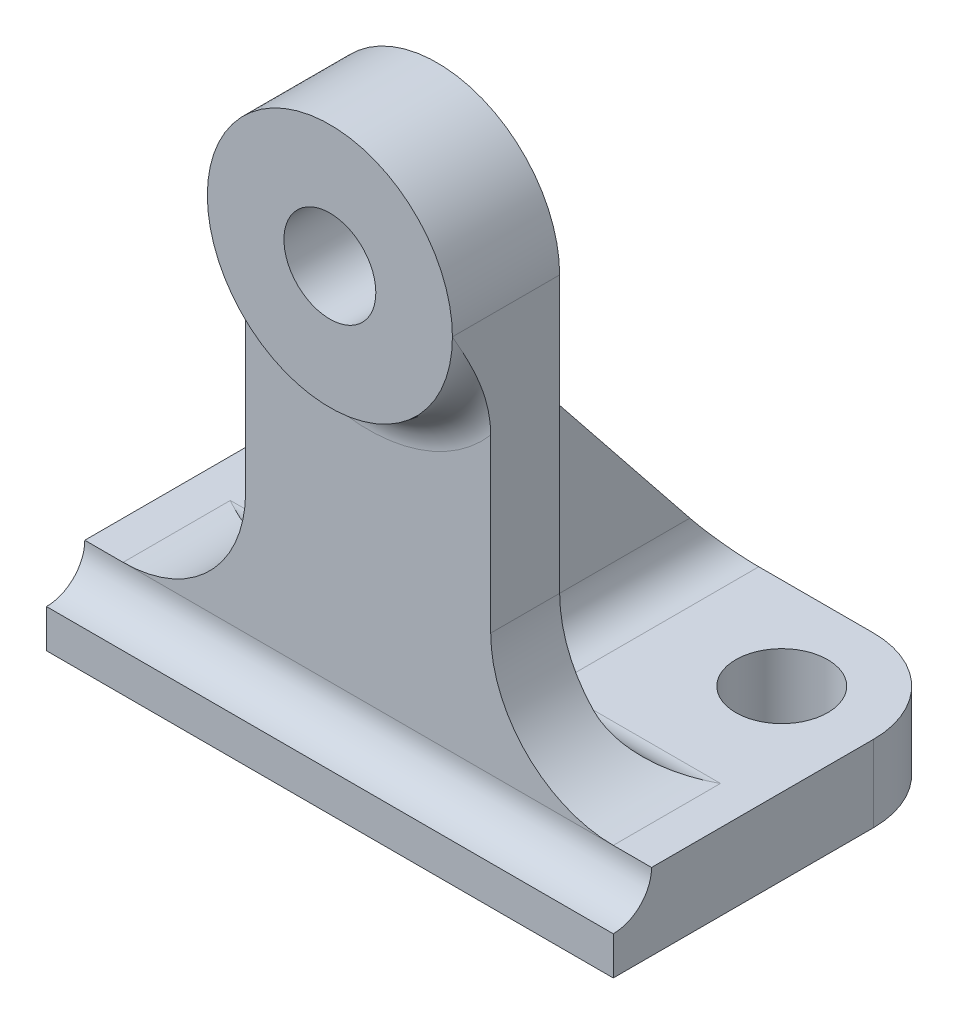
ISO-10303-21;
HEADER;
FILE_DESCRIPTION(('STEP AP214'),'2;1');
FILE_NAME('part.step','',(''),(''),'','','');
FILE_SCHEMA(('AUTOMOTIVE_DESIGN { 1 0 10303 214 1 1 1 1 }'));
ENDSEC;
DATA;
#1=APPLICATION_CONTEXT('core data for automotive mechanical design processes');
#2=APPLICATION_PROTOCOL_DEFINITION('international standard','automotive_design',2000,#1);
#3=PRODUCT_CONTEXT('',#1,'mechanical');
#4=PRODUCT('Part','Part','',(#3));
#5=PRODUCT_RELATED_PRODUCT_CATEGORY('part','',(#4));
#6=PRODUCT_DEFINITION_FORMATION('','',#4);
#7=PRODUCT_DEFINITION_CONTEXT('part definition',#1,'design');
#8=PRODUCT_DEFINITION('design','',#6,#7);
#9=PRODUCT_DEFINITION_SHAPE('','',#8);
#10=(LENGTH_UNIT() NAMED_UNIT(*) SI_UNIT(.MILLI.,.METRE.));
#11=(NAMED_UNIT(*) PLANE_ANGLE_UNIT() SI_UNIT($,.RADIAN.));
#12=(NAMED_UNIT(*) SI_UNIT($,.STERADIAN.) SOLID_ANGLE_UNIT());
#13=UNCERTAINTY_MEASURE_WITH_UNIT(LENGTH_MEASURE(1.E-05),#10,'distance_accuracy_value','');
#14=(GEOMETRIC_REPRESENTATION_CONTEXT(3) GLOBAL_UNCERTAINTY_ASSIGNED_CONTEXT((#13)) GLOBAL_UNIT_ASSIGNED_CONTEXT((#10,
#11,#12)) REPRESENTATION_CONTEXT('',''));
#15=CARTESIAN_POINT('',(0.,0.,0.));
#16=DIRECTION('',(0.,0.,1.));
#17=DIRECTION('',(1.,0.,0.));
#18=AXIS2_PLACEMENT_3D('',#15,#16,#17);
#19=CARTESIAN_POINT('',(12.,10.,-34.));
#20=DIRECTION('',(0.,-1.,0.));
#21=DIRECTION('',(0.,0.,-1.));
#22=AXIS2_PLACEMENT_3D('',#19,#20,#21);
#23=PLANE('',#22);
#24=CARTESIAN_POINT('',(62.,10.,-34.));
#25=DIRECTION('',(0.,1.,0.));
#26=DIRECTION('',(0.,0.,1.));
#27=AXIS2_PLACEMENT_3D('',#24,#25,#26);
#28=CIRCLE('',#27,6.);
#29=CARTESIAN_POINT('',(62.,10.,-28.));
#30=VERTEX_POINT('',#29);
#31=EDGE_CURVE('E578',#30,#30,#28,.T.);
#32=ORIENTED_EDGE('',*,*,#31,.F.);
#33=EDGE_LOOP('',(#32));
#34=FACE_BOUND('',#33,.T.);
#35=DIRECTION('',(-1.,0.,0.));
#36=VECTOR('',#35,1.);
#37=CARTESIAN_POINT('',(12.0000000000001,10.,-46.));
#38=LINE('',#37,#36);
#39=CARTESIAN_POINT('',(62.,10.,-46.));
#40=VERTEX_POINT('',#39);
#41=CARTESIAN_POINT('',(47.,10.,-46.));
#42=VERTEX_POINT('',#41);
#43=EDGE_CURVE('E240',#40,#42,#38,.T.);
#44=ORIENTED_EDGE('',*,*,#43,.T.);
#45=DIRECTION('',(0.,0.,-1.));
#46=VECTOR('',#45,1.);
#47=CARTESIAN_POINT('',(47.,10.,-19.));
#48=LINE('',#47,#46);
#49=CARTESIAN_POINT('',(47.,10.,-19.));
#50=VERTEX_POINT('',#49);
#51=EDGE_CURVE('E443',#42,#50,#48,.F.);
#52=ORIENTED_EDGE('',*,*,#51,.T.);
#53=DIRECTION('',(1.,0.,0.));
#54=VECTOR('',#53,1.);
#55=CARTESIAN_POINT('',(53.,10.,-19.));
#56=LINE('',#55,#54);
#57=CARTESIAN_POINT('',(69.,10.,-19.));
#58=VERTEX_POINT('',#57);
#59=EDGE_CURVE('E248',#50,#58,#56,.T.);
#60=ORIENTED_EDGE('',*,*,#59,.T.);
#61=DIRECTION('',(0.,0.,1.));
#62=VECTOR('',#61,1.);
#63=CARTESIAN_POINT('',(69.,10.,-5.));
#64=LINE('',#63,#62);
#65=CARTESIAN_POINT('',(69.,10.,-5.));
#66=VERTEX_POINT('',#65);
#67=EDGE_CURVE('E214',#58,#66,#64,.T.);
#68=ORIENTED_EDGE('',*,*,#67,.T.);
#69=DIRECTION('',(-1.,0.,0.));
#70=VECTOR('',#69,1.);
#71=CARTESIAN_POINT('',(74.,10.,-5.));
#72=LINE('',#71,#70);
#73=CARTESIAN_POINT('',(74.,10.,-5.));
#74=VERTEX_POINT('',#73);
#75=EDGE_CURVE('E199',#74,#66,#72,.T.);
#76=ORIENTED_EDGE('',*,*,#75,.F.);
#77=DIRECTION('',(0.,0.,-1.));
#78=VECTOR('',#77,1.);
#79=CARTESIAN_POINT('',(74.,10.,0.));
#80=LINE('',#79,#78);
#81=CARTESIAN_POINT('',(74.,10.,-34.));
#82=VERTEX_POINT('',#81);
#83=EDGE_CURVE('E211',#74,#82,#80,.T.);
#84=ORIENTED_EDGE('',*,*,#83,.T.);
#85=CARTESIAN_POINT('',(62.,10.,-34.));
#86=DIRECTION('',(0.,1.,0.));
#87=DIRECTION('',(0.,0.,-1.));
#88=AXIS2_PLACEMENT_3D('',#85,#86,#87);
#89=CIRCLE('',#88,12.);
#90=EDGE_CURVE('E221',#82,#40,#89,.T.);
#91=ORIENTED_EDGE('',*,*,#90,.T.);
#92=EDGE_LOOP('',(#44,#52,#60,#68,#76,#84,#91));
#93=FACE_BOUND('',#92,.T.);
#94=ADVANCED_FACE('F40',(#34,#93),#23,.F.);
#95=CARTESIAN_POINT('',(12.,10.,-34.));
#96=DIRECTION('',(0.,1.,0.));
#97=DIRECTION('',(0.,0.,1.));
#98=AXIS2_PLACEMENT_3D('',#95,#96,#97);
#99=CIRCLE('',#98,6.);
#100=CARTESIAN_POINT('',(12.,10.,-28.));
#101=VERTEX_POINT('',#100);
#102=EDGE_CURVE('E430',#101,#101,#99,.T.);
#103=ORIENTED_EDGE('',*,*,#102,.F.);
#104=EDGE_LOOP('',(#103));
#105=FACE_BOUND('',#104,.T.);
#106=DIRECTION('',(1.,0.,0.));
#107=VECTOR('',#106,1.);
#108=CARTESIAN_POINT('',(32.,10.,-19.));
#109=LINE('',#108,#107);
#110=CARTESIAN_POINT('',(5.00000000000004,10.,-19.));
#111=VERTEX_POINT('',#110);
#112=CARTESIAN_POINT('',(27.,10.,-19.));
#113=VERTEX_POINT('',#112);
#114=EDGE_CURVE('E245',#111,#113,#109,.T.);
#115=ORIENTED_EDGE('',*,*,#114,.T.);
#116=DIRECTION('',(0.,0.,-1.));
#117=VECTOR('',#116,1.);
#118=CARTESIAN_POINT('',(27.,10.,-34.));
#119=LINE('',#118,#117);
#120=CARTESIAN_POINT('',(27.,10.,-46.));
#121=VERTEX_POINT('',#120);
#122=EDGE_CURVE('E459',#113,#121,#119,.T.);
#123=ORIENTED_EDGE('',*,*,#122,.T.);
#124=CARTESIAN_POINT('',(12.0000000000001,10.,-46.));
#125=VERTEX_POINT('',#124);
#126=EDGE_CURVE('E224',#121,#125,#38,.T.);
#127=ORIENTED_EDGE('',*,*,#126,.T.);
#128=CARTESIAN_POINT('',(12.,10.,-34.));
#129=DIRECTION('',(0.,1.,0.));
#130=DIRECTION('',(0.,0.,-1.));
#131=AXIS2_PLACEMENT_3D('',#128,#129,#130);
#132=CIRCLE('',#131,12.);
#133=CARTESIAN_POINT('',(0.,10.,-33.9999999999999));
#134=VERTEX_POINT('',#133);
#135=EDGE_CURVE('E233',#125,#134,#132,.T.);
#136=ORIENTED_EDGE('',*,*,#135,.T.);
#137=DIRECTION('',(0.,0.,1.));
#138=VECTOR('',#137,1.);
#139=CARTESIAN_POINT('',(0.,10.,0.));
#140=LINE('',#139,#138);
#141=CARTESIAN_POINT('',(0.,10.,-5.));
#142=VERTEX_POINT('',#141);
#143=EDGE_CURVE('E222',#134,#142,#140,.T.);
#144=ORIENTED_EDGE('',*,*,#143,.T.);
#145=CARTESIAN_POINT('',(5.00000000000005,10.,-5.));
#146=VERTEX_POINT('',#145);
#147=EDGE_CURVE('E205',#146,#142,#72,.T.);
#148=ORIENTED_EDGE('',*,*,#147,.F.);
#149=DIRECTION('',(0.,0.,-1.));
#150=VECTOR('',#149,1.);
#151=CARTESIAN_POINT('',(5.00000000000004,10.,-19.));
#152=LINE('',#151,#150);
#153=EDGE_CURVE('E290',#146,#111,#152,.T.);
#154=ORIENTED_EDGE('',*,*,#153,.T.);
#155=EDGE_LOOP('',(#115,#123,#127,#136,#144,#148,#154));
#156=FACE_BOUND('',#155,.T.);
#157=ADVANCED_FACE('F352',(#105,#156),#23,.F.);
#158=CARTESIAN_POINT('',(0.,10.,0.));
#159=DIRECTION('',(0.,0.,-1.));
#160=DIRECTION('',(-1.,0.,0.));
#161=AXIS2_PLACEMENT_3D('',#158,#159,#160);
#162=PLANE('',#161);
#163=DIRECTION('',(-1.,0.,0.));
#164=VECTOR('',#163,1.);
#165=CARTESIAN_POINT('',(74.,5.,0.));
#166=LINE('',#165,#164);
#167=CARTESIAN_POINT('',(0.,5.,0.));
#168=VERTEX_POINT('',#167);
#169=CARTESIAN_POINT('',(74.,5.,0.));
#170=VERTEX_POINT('',#169);
#171=EDGE_CURVE('E201',#168,#170,#166,.F.);
#172=ORIENTED_EDGE('',*,*,#171,.F.);
#173=DIRECTION('',(0.,-1.,0.));
#174=VECTOR('',#173,1.);
#175=CARTESIAN_POINT('',(0.,10.,0.));
#176=LINE('',#175,#174);
#177=CARTESIAN_POINT('',(0.,0.,0.));
#178=VERTEX_POINT('',#177);
#179=EDGE_CURVE('E243',#168,#178,#176,.T.);
#180=ORIENTED_EDGE('',*,*,#179,.T.);
#181=DIRECTION('',(1.,0.,0.));
#182=VECTOR('',#181,1.);
#183=CARTESIAN_POINT('',(0.,0.,0.));
#184=LINE('',#183,#182);
#185=CARTESIAN_POINT('',(74.,0.,0.));
#186=VERTEX_POINT('',#185);
#187=EDGE_CURVE('E422',#178,#186,#184,.T.);
#188=ORIENTED_EDGE('',*,*,#187,.T.);
#189=DIRECTION('',(0.,-1.,0.));
#190=VECTOR('',#189,1.);
#191=CARTESIAN_POINT('',(74.,10.,0.));
#192=LINE('',#191,#190);
#193=EDGE_CURVE('E419',#170,#186,#192,.T.);
#194=ORIENTED_EDGE('',*,*,#193,.F.);
#195=EDGE_LOOP('',(#172,#180,#188,#194));
#196=FACE_BOUND('',#195,.T.);
#197=ADVANCED_FACE('F358',(#196),#162,.F.);
#198=CARTESIAN_POINT('',(12.,0.,-34.));
#199=DIRECTION('',(0.,-1.,0.));
#200=DIRECTION('',(0.,0.,-1.));
#201=AXIS2_PLACEMENT_3D('',#198,#199,#200);
#202=PLANE('',#201);
#203=CARTESIAN_POINT('',(12.,0.,-34.));
#204=DIRECTION('',(0.,1.,0.));
#205=DIRECTION('',(0.,0.,1.));
#206=AXIS2_PLACEMENT_3D('',#203,#204,#205);
#207=CIRCLE('',#206,6.);
#208=CARTESIAN_POINT('',(12.,0.,-28.));
#209=VERTEX_POINT('',#208);
#210=EDGE_CURVE('E432',#209,#209,#207,.T.);
#211=ORIENTED_EDGE('',*,*,#210,.T.);
#212=EDGE_LOOP('',(#211));
#213=FACE_BOUND('',#212,.T.);
#214=DIRECTION('',(0.,0.,1.));
#215=VECTOR('',#214,1.);
#216=CARTESIAN_POINT('',(0.,0.,0.));
#217=LINE('',#216,#215);
#218=CARTESIAN_POINT('',(0.,0.,-33.9999999999999));
#219=VERTEX_POINT('',#218);
#220=EDGE_CURVE('E426',#219,#178,#217,.T.);
#221=ORIENTED_EDGE('',*,*,#220,.F.);
#222=CARTESIAN_POINT('',(12.,0.,-34.));
#223=DIRECTION('',(0.,1.,0.));
#224=DIRECTION('',(0.,0.,-1.));
#225=AXIS2_PLACEMENT_3D('',#222,#223,#224);
#226=CIRCLE('',#225,12.);
#227=CARTESIAN_POINT('',(12.0000000000001,0.,-46.));
#228=VERTEX_POINT('',#227);
#229=EDGE_CURVE('E227',#228,#219,#226,.T.);
#230=ORIENTED_EDGE('',*,*,#229,.F.);
#231=DIRECTION('',(-1.,0.,0.));
#232=VECTOR('',#231,1.);
#233=CARTESIAN_POINT('',(12.0000000000001,0.,-46.));
#234=LINE('',#233,#232);
#235=CARTESIAN_POINT('',(62.,0.,-46.));
#236=VERTEX_POINT('',#235);
#237=EDGE_CURVE('E437',#236,#228,#234,.T.);
#238=ORIENTED_EDGE('',*,*,#237,.F.);
#239=CARTESIAN_POINT('',(62.,0.,-34.));
#240=DIRECTION('',(0.,1.,0.));
#241=DIRECTION('',(0.,0.,-1.));
#242=AXIS2_PLACEMENT_3D('',#239,#240,#241);
#243=CIRCLE('',#242,12.);
#244=CARTESIAN_POINT('',(74.,0.,-34.));
#245=VERTEX_POINT('',#244);
#246=EDGE_CURVE('E436',#245,#236,#243,.T.);
#247=ORIENTED_EDGE('',*,*,#246,.F.);
#248=DIRECTION('',(0.,0.,-1.));
#249=VECTOR('',#248,1.);
#250=CARTESIAN_POINT('',(74.,0.,0.));
#251=LINE('',#250,#249);
#252=EDGE_CURVE('E428',#186,#245,#251,.T.);
#253=ORIENTED_EDGE('',*,*,#252,.F.);
#254=ORIENTED_EDGE('',*,*,#187,.F.);
#255=EDGE_LOOP('',(#221,#230,#238,#247,#253,#254));
#256=FACE_BOUND('',#255,.T.);
#257=CARTESIAN_POINT('',(62.,0.,-34.));
#258=DIRECTION('',(0.,1.,0.));
#259=DIRECTION('',(0.,0.,1.));
#260=AXIS2_PLACEMENT_3D('',#257,#258,#259);
#261=CIRCLE('',#260,6.);
#262=CARTESIAN_POINT('',(62.,0.,-28.));
#263=VERTEX_POINT('',#262);
#264=EDGE_CURVE('E274',#263,#263,#261,.T.);
#265=ORIENTED_EDGE('',*,*,#264,.T.);
#266=EDGE_LOOP('',(#265));
#267=FACE_BOUND('',#266,.T.);
#268=ADVANCED_FACE('F365',(#213,#256,#267),#202,.T.);
#269=CARTESIAN_POINT('',(0.,10.,0.));
#270=DIRECTION('',(1.,0.,0.));
#271=DIRECTION('',(0.,0.,-1.));
#272=AXIS2_PLACEMENT_3D('',#269,#270,#271);
#273=PLANE('',#272);
#274=CARTESIAN_POINT('',(0.,10.,0.));
#275=DIRECTION('',(1.,0.,0.));
#276=DIRECTION('',(0.,0.,-1.));
#277=AXIS2_PLACEMENT_3D('',#274,#275,#276);
#278=CIRCLE('',#277,5.);
#279=EDGE_CURVE('E206',#168,#142,#278,.T.);
#280=ORIENTED_EDGE('',*,*,#279,.T.);
#281=ORIENTED_EDGE('',*,*,#143,.F.);
#282=DIRECTION('',(0.,-1.,0.));
#283=VECTOR('',#282,1.);
#284=CARTESIAN_POINT('',(0.,10.,-33.9999999999999));
#285=LINE('',#284,#283);
#286=EDGE_CURVE('E407',#134,#219,#285,.T.);
#287=ORIENTED_EDGE('',*,*,#286,.T.);
#288=ORIENTED_EDGE('',*,*,#220,.T.);
#289=ORIENTED_EDGE('',*,*,#179,.F.);
#290=EDGE_LOOP('',(#280,#281,#287,#288,#289));
#291=FACE_BOUND('',#290,.T.);
#292=ADVANCED_FACE('F368',(#291),#273,.F.);
#293=CARTESIAN_POINT('',(74.,10.,0.));
#294=DIRECTION('',(-1.,0.,0.));
#295=DIRECTION('',(0.,0.,1.));
#296=AXIS2_PLACEMENT_3D('',#293,#294,#295);
#297=PLANE('',#296);
#298=CARTESIAN_POINT('',(74.,10.,0.));
#299=DIRECTION('',(1.,0.,0.));
#300=DIRECTION('',(0.,0.,-1.));
#301=AXIS2_PLACEMENT_3D('',#298,#299,#300);
#302=CIRCLE('',#301,5.);
#303=EDGE_CURVE('E196',#170,#74,#302,.T.);
#304=ORIENTED_EDGE('',*,*,#303,.F.);
#305=ORIENTED_EDGE('',*,*,#193,.T.);
#306=ORIENTED_EDGE('',*,*,#252,.T.);
#307=DIRECTION('',(0.,-1.,0.));
#308=VECTOR('',#307,1.);
#309=CARTESIAN_POINT('',(74.,10.,-34.));
#310=LINE('',#309,#308);
#311=EDGE_CURVE('E219',#82,#245,#310,.T.);
#312=ORIENTED_EDGE('',*,*,#311,.F.);
#313=ORIENTED_EDGE('',*,*,#83,.F.);
#314=EDGE_LOOP('',(#304,#305,#306,#312,#313));
#315=FACE_BOUND('',#314,.T.);
#316=ADVANCED_FACE('F217',(#315),#297,.F.);
#317=CARTESIAN_POINT('',(62.,10.,-34.));
#318=DIRECTION('',(0.,-1.,0.));
#319=DIRECTION('',(0.,0.,-1.));
#320=AXIS2_PLACEMENT_3D('',#317,#318,#319);
#321=CYLINDRICAL_SURFACE('',#320,12.);
#322=ORIENTED_EDGE('',*,*,#246,.T.);
#323=DIRECTION('',(0.,-1.,0.));
#324=VECTOR('',#323,1.);
#325=CARTESIAN_POINT('',(62.,10.,-46.));
#326=LINE('',#325,#324);
#327=EDGE_CURVE('E412',#40,#236,#326,.T.);
#328=ORIENTED_EDGE('',*,*,#327,.F.);
#329=ORIENTED_EDGE('',*,*,#90,.F.);
#330=ORIENTED_EDGE('',*,*,#311,.T.);
#331=EDGE_LOOP('',(#322,#328,#329,#330));
#332=FACE_BOUND('',#331,.T.);
#333=ADVANCED_FACE('F377',(#332),#321,.T.);
#334=CARTESIAN_POINT('',(12.0000000000001,10.,-46.));
#335=DIRECTION('',(0.,0.,1.));
#336=DIRECTION('',(1.,0.,0.));
#337=AXIS2_PLACEMENT_3D('',#334,#335,#336);
#338=PLANE('',#337);
#339=ORIENTED_EDGE('',*,*,#237,.T.);
#340=DIRECTION('',(0.,-1.,0.));
#341=VECTOR('',#340,1.);
#342=CARTESIAN_POINT('',(12.0000000000001,10.,-46.));
#343=LINE('',#342,#341);
#344=EDGE_CURVE('E410',#125,#228,#343,.T.);
#345=ORIENTED_EDGE('',*,*,#344,.F.);
#346=ORIENTED_EDGE('',*,*,#126,.F.);
#347=DIRECTION('',(-1.,0.,0.));
#348=VECTOR('',#347,1.);
#349=CARTESIAN_POINT('',(37.,10.,-46.));
#350=LINE('',#349,#348);
#351=EDGE_CURVE('E450',#42,#121,#350,.T.);
#352=ORIENTED_EDGE('',*,*,#351,.F.);
#353=ORIENTED_EDGE('',*,*,#43,.F.);
#354=ORIENTED_EDGE('',*,*,#327,.T.);
#355=EDGE_LOOP('',(#339,#345,#346,#352,#353,#354));
#356=FACE_BOUND('',#355,.T.);
#357=ADVANCED_FACE('F373',(#356),#338,.F.);
#358=CARTESIAN_POINT('',(12.,10.,-34.));
#359=DIRECTION('',(0.,-1.,0.));
#360=DIRECTION('',(0.,0.,-1.));
#361=AXIS2_PLACEMENT_3D('',#358,#359,#360);
#362=CYLINDRICAL_SURFACE('',#361,12.);
#363=ORIENTED_EDGE('',*,*,#229,.T.);
#364=ORIENTED_EDGE('',*,*,#286,.F.);
#365=ORIENTED_EDGE('',*,*,#135,.F.);
#366=ORIENTED_EDGE('',*,*,#344,.T.);
#367=EDGE_LOOP('',(#363,#364,#365,#366));
#368=FACE_BOUND('',#367,.T.);
#369=ADVANCED_FACE('F370',(#368),#362,.T.);
#370=CARTESIAN_POINT('',(12.,10.,-34.));
#371=DIRECTION('',(0.,-1.,0.));
#372=DIRECTION('',(0.,0.,-1.));
#373=AXIS2_PLACEMENT_3D('',#370,#371,#372);
#374=CYLINDRICAL_SURFACE('',#373,6.);
#375=ORIENTED_EDGE('',*,*,#102,.T.);
#376=EDGE_LOOP('',(#375));
#377=FACE_BOUND('',#376,.T.);
#378=ORIENTED_EDGE('',*,*,#210,.F.);
#379=EDGE_LOOP('',(#378));
#380=FACE_BOUND('',#379,.T.);
#381=ADVANCED_FACE('F363',(#377,#380),#374,.F.);
#382=CARTESIAN_POINT('',(62.,10.,-34.));
#383=DIRECTION('',(0.,-1.,0.));
#384=DIRECTION('',(0.,0.,-1.));
#385=AXIS2_PLACEMENT_3D('',#382,#383,#384);
#386=CYLINDRICAL_SURFACE('',#385,6.);
#387=ORIENTED_EDGE('',*,*,#31,.T.);
#388=EDGE_LOOP('',(#387));
#389=FACE_BOUND('',#388,.T.);
#390=ORIENTED_EDGE('',*,*,#264,.F.);
#391=EDGE_LOOP('',(#390));
#392=FACE_BOUND('',#391,.T.);
#393=ADVANCED_FACE('F567',(#389,#392),#386,.F.);
#394=CARTESIAN_POINT('',(53.,10.,-14.));
#395=DIRECTION('',(0.,0.,1.));
#396=DIRECTION('',(1.,0.,0.));
#397=AXIS2_PLACEMENT_3D('',#394,#395,#396);
#398=PLANE('',#397);
#399=CARTESIAN_POINT('',(37.,62.,-14.));
#400=DIRECTION('',(0.,0.,1.));
#401=DIRECTION('',(1.,0.,0.));
#402=AXIS2_PLACEMENT_3D('',#399,#400,#401);
#403=CIRCLE('',#402,6.00000000000001);
#404=CARTESIAN_POINT('',(43.,62.,-14.));
#405=VERTEX_POINT('',#404);
#406=EDGE_CURVE('E483',#405,#405,#403,.T.);
#407=ORIENTED_EDGE('',*,*,#406,.T.);
#408=EDGE_LOOP('',(#407));
#409=FACE_BOUND('',#408,.T.);
#410=DIRECTION('',(1.,0.,0.));
#411=VECTOR('',#410,1.);
#412=CARTESIAN_POINT('',(42.,15.,-14.));
#413=LINE('',#412,#411);
#414=CARTESIAN_POINT('',(57.3810499613778,15.,-14.));
#415=VERTEX_POINT('',#414);
#416=CARTESIAN_POINT('',(47.,15.,-14.));
#417=VERTEX_POINT('',#416);
#418=EDGE_CURVE('E252',#415,#417,#413,.F.);
#419=ORIENTED_EDGE('',*,*,#418,.T.);
#420=DIRECTION('',(0.,-1.,0.));
#421=VECTOR('',#420,1.);
#422=CARTESIAN_POINT('',(47.,50.,-14.));
#423=LINE('',#422,#421);
#424=CARTESIAN_POINT('',(47.,50.,-14.));
#425=VERTEX_POINT('',#424);
#426=EDGE_CURVE('E533',#417,#425,#423,.F.);
#427=ORIENTED_EDGE('',*,*,#426,.T.);
#428=DIRECTION('',(-1.,0.,0.));
#429=VECTOR('',#428,1.);
#430=CARTESIAN_POINT('',(37.,50.,-14.));
#431=LINE('',#430,#429);
#432=CARTESIAN_POINT('',(27.,50.,-14.));
#433=VERTEX_POINT('',#432);
#434=EDGE_CURVE('E473',#425,#433,#431,.T.);
#435=ORIENTED_EDGE('',*,*,#434,.T.);
#436=DIRECTION('',(0.,-1.,0.));
#437=VECTOR('',#436,1.);
#438=CARTESIAN_POINT('',(27.,10.,-14.));
#439=LINE('',#438,#437);
#440=CARTESIAN_POINT('',(27.,15.,-14.));
#441=VERTEX_POINT('',#440);
#442=EDGE_CURVE('E531',#433,#441,#439,.T.);
#443=ORIENTED_EDGE('',*,*,#442,.T.);
#444=DIRECTION('',(1.,0.,0.));
#445=VECTOR('',#444,1.);
#446=CARTESIAN_POINT('',(21.,15.,-14.));
#447=LINE('',#446,#445);
#448=CARTESIAN_POINT('',(16.6189500386223,15.,-14.));
#449=VERTEX_POINT('',#448);
#450=EDGE_CURVE('E250',#441,#449,#447,.F.);
#451=ORIENTED_EDGE('',*,*,#450,.T.);
#452=CARTESIAN_POINT('',(5.00000000000004,26.,-14.));
#453=DIRECTION('',(0.,0.,1.));
#454=DIRECTION('',(1.,0.,0.));
#455=AXIS2_PLACEMENT_3D('',#452,#453,#454);
#456=CIRCLE('',#455,16.);
#457=CARTESIAN_POINT('',(21.,26.,-14.));
#458=VERTEX_POINT('',#457);
#459=EDGE_CURVE('E815',#449,#458,#456,.T.);
#460=ORIENTED_EDGE('',*,*,#459,.T.);
#461=DIRECTION('',(0.,1.,0.));
#462=VECTOR('',#461,1.);
#463=CARTESIAN_POINT('',(21.,10.,-14.));
#464=LINE('',#463,#462);
#465=CARTESIAN_POINT('',(21.,62.,-14.));
#466=VERTEX_POINT('',#465);
#467=EDGE_CURVE('E284',#458,#466,#464,.T.);
#468=ORIENTED_EDGE('',*,*,#467,.T.);
#469=CARTESIAN_POINT('',(37.,62.,-14.));
#470=DIRECTION('',(0.,0.,1.));
#471=DIRECTION('',(1.,0.,0.));
#472=AXIS2_PLACEMENT_3D('',#469,#470,#471);
#473=CIRCLE('',#472,16.);
#474=CARTESIAN_POINT('',(53.,62.,-14.));
#475=VERTEX_POINT('',#474);
#476=EDGE_CURVE('E489',#475,#466,#473,.T.);
#477=ORIENTED_EDGE('',*,*,#476,.F.);
#478=DIRECTION('',(0.,1.,0.));
#479=VECTOR('',#478,1.);
#480=CARTESIAN_POINT('',(53.,10.,-14.));
#481=LINE('',#480,#479);
#482=CARTESIAN_POINT('',(53.,26.,-14.));
#483=VERTEX_POINT('',#482);
#484=EDGE_CURVE('E263',#483,#475,#481,.T.);
#485=ORIENTED_EDGE('',*,*,#484,.F.);
#486=CARTESIAN_POINT('',(69.,26.,-14.));
#487=DIRECTION('',(0.,0.,1.));
#488=DIRECTION('',(1.,0.,0.));
#489=AXIS2_PLACEMENT_3D('',#486,#487,#488);
#490=CIRCLE('',#489,16.);
#491=EDGE_CURVE('E292',#483,#415,#490,.T.);
#492=ORIENTED_EDGE('',*,*,#491,.T.);
#493=EDGE_LOOP('',(#419,#427,#435,#443,#451,#460,#468,#477,#485,#492));
#494=FACE_BOUND('',#493,.T.);
#495=ADVANCED_FACE('F540',(#409,#494),#398,.F.);
#496=CARTESIAN_POINT('',(21.,10.,-14.));
#497=DIRECTION('',(1.,0.,0.));
#498=DIRECTION('',(0.,0.,-1.));
#499=AXIS2_PLACEMENT_3D('',#496,#497,#498);
#500=PLANE('',#499);
#501=ORIENTED_EDGE('',*,*,#467,.F.);
#502=DIRECTION('',(0.,0.,-1.));
#503=VECTOR('',#502,1.);
#504=CARTESIAN_POINT('',(21.,26.,-4.99999999999999));
#505=LINE('',#504,#503);
#506=CARTESIAN_POINT('',(21.,26.,-4.99999999999999));
#507=VERTEX_POINT('',#506);
#508=EDGE_CURVE('E287',#458,#507,#505,.F.);
#509=ORIENTED_EDGE('',*,*,#508,.T.);
#510=DIRECTION('',(0.,1.,0.));
#511=VECTOR('',#510,1.);
#512=CARTESIAN_POINT('',(21.,9.99999999999999,-4.99999999999999));
#513=LINE('',#512,#511);
#514=CARTESIAN_POINT('',(21.,48.3985294912645,-4.99999999999999));
#515=VERTEX_POINT('',#514);
#516=EDGE_CURVE('E262',#507,#515,#513,.T.);
#517=ORIENTED_EDGE('',*,*,#516,.T.);
#518=CARTESIAN_POINT('',(21.,48.3985294912646,-4.99999999999999));
#519=CARTESIAN_POINT('',(21.,48.5954076365688,-4.99999232401073));
#520=CARTESIAN_POINT('',(21.,48.7922337353775,-4.99512291722183));
#521=CARTESIAN_POINT('',(21.,49.1853878297254,-4.97634809061944));
#522=CARTESIAN_POINT('',(21.,49.3817159804627,-4.96244595972365));
#523=CARTESIAN_POINT('',(21.,49.9687005356491,-4.90829615485198));
#524=CARTESIAN_POINT('',(21.,50.3582411037477,-4.8555988161053));
#525=CARTESIAN_POINT('',(21.,51.1269338991172,-4.7227897894896));
#526=CARTESIAN_POINT('',(21.,51.5061553171629,-4.64306513589056));
#527=CARTESIAN_POINT('',(21.,52.259060778871,-4.46010532528284));
#528=CARTESIAN_POINT('',(21.,52.632741400848,-4.35685623631856));
#529=CARTESIAN_POINT('',(21.,53.3980744154361,-4.12314132407387));
#530=CARTESIAN_POINT('',(21.,53.7893158812843,-3.99134250923351));
#531=CARTESIAN_POINT('',(21.,54.5650422848327,-3.70904098749949));
#532=CARTESIAN_POINT('',(21.,54.9495254569452,-3.55853347352143));
#533=CARTESIAN_POINT('',(21.,55.712365949029,-3.24214004732481));
#534=CARTESIAN_POINT('',(21.,56.090719014497,-3.07624395037235));
#535=CARTESIAN_POINT('',(21.,56.8418247535103,-2.73217687893123));
#536=CARTESIAN_POINT('',(21.,57.2145767097425,-2.55400434829303));
#537=CARTESIAN_POINT('',(21.,58.3301038199385,-2.00313526167887));
#538=CARTESIAN_POINT('',(21.,59.0657058225712,-1.6160050119104));
#539=CARTESIAN_POINT('',(21.0000000000001,60.5268595155453,-0.823396616194521));
#540=CARTESIAN_POINT('',(21.0000000000001,61.2524091756104,-0.417914832352274));
#541=CARTESIAN_POINT('',(21.,61.9852786003488,-0.00822951171862071));
#542=CARTESIAN_POINT('',(21.,61.9926392996398,-0.00411475570383011));
#543=CARTESIAN_POINT('',(21.,62.,0.));
#544=B_SPLINE_CURVE_WITH_KNOTS('',3,(#518,#519,#520,#521,#522,#523,#524,#525,#526,#527,#528,
#529,#530,#531,#532,#533,#534,#535,#536,#537,#538,#539,#540,#541,#542,#543),.UNSPECIFIED.,.F.,
.F.,(4,2,2,2,2,2,2,2,2,2,2,2,4),(0.,0.590489426389476,1.18076396925154,2.3586701522712,
3.52037506987632,4.68276978451745,5.9207312146461,7.15901139136536,8.39811703604022,
9.6373800386074,12.1304062029131,14.6239287526897,14.6492269739717),.UNSPECIFIED.);
#545=CARTESIAN_POINT('',(21.,62.,0.));
#546=VERTEX_POINT('',#545);
#547=EDGE_CURVE('E54',#515,#546,#544,.T.);
#548=ORIENTED_EDGE('',*,*,#547,.T.);
#549=DIRECTION('',(0.,0.,-1.));
#550=VECTOR('',#549,1.);
#551=CARTESIAN_POINT('',(21.,62.,-14.));
#552=LINE('',#551,#550);
#553=EDGE_CURVE('E61',#546,#466,#552,.T.);
#554=ORIENTED_EDGE('',*,*,#553,.T.);
#555=EDGE_LOOP('',(#501,#509,#517,#548,#554));
#556=FACE_BOUND('',#555,.T.);
#557=ADVANCED_FACE('F557',(#556),#500,.F.);
#558=CARTESIAN_POINT('',(53.,10.,-5.));
#559=DIRECTION('',(0.,0.,-1.));
#560=DIRECTION('',(-1.,0.,0.));
#561=AXIS2_PLACEMENT_3D('',#558,#559,#560);
#562=PLANE('',#561);
#563=DIRECTION('',(0.,1.,0.));
#564=VECTOR('',#563,1.);
#565=CARTESIAN_POINT('',(53.,10.,-5.));
#566=LINE('',#565,#564);
#567=CARTESIAN_POINT('',(53.,26.,-5.));
#568=VERTEX_POINT('',#567);
#569=CARTESIAN_POINT('',(53.,48.3985294912645,-5.));
#570=VERTEX_POINT('',#569);
#571=EDGE_CURVE('E257',#568,#570,#566,.T.);
#572=ORIENTED_EDGE('',*,*,#571,.T.);
#573=CARTESIAN_POINT('',(37.,62.,-4.99999999999999));
#574=DIRECTION('',(0.,0.,-1.));
#575=DIRECTION('',(-1.,0.,0.));
#576=AXIS2_PLACEMENT_3D('',#573,#574,#575);
#577=CIRCLE('',#576,21.);
#578=EDGE_CURVE('E504',#570,#515,#577,.T.);
#579=ORIENTED_EDGE('',*,*,#578,.T.);
#580=ORIENTED_EDGE('',*,*,#516,.F.);
#581=CARTESIAN_POINT('',(5.00000000000004,26.,-4.99999999999999));
#582=DIRECTION('',(0.,0.,-1.));
#583=DIRECTION('',(-1.,0.,0.));
#584=AXIS2_PLACEMENT_3D('',#581,#582,#583);
#585=CIRCLE('',#584,16.);
#586=EDGE_CURVE('E525',#507,#146,#585,.T.);
#587=ORIENTED_EDGE('',*,*,#586,.T.);
#588=DIRECTION('',(-1.,0.,0.));
#589=VECTOR('',#588,1.);
#590=CARTESIAN_POINT('',(53.,10.,-5.));
#591=LINE('',#590,#589);
#592=EDGE_CURVE('E261',#66,#146,#591,.T.);
#593=ORIENTED_EDGE('',*,*,#592,.F.);
#594=CARTESIAN_POINT('',(69.,26.,-5.));
#595=DIRECTION('',(0.,0.,-1.));
#596=DIRECTION('',(-1.,0.,0.));
#597=AXIS2_PLACEMENT_3D('',#594,#595,#596);
#598=CIRCLE('',#597,16.);
#599=EDGE_CURVE('E289',#66,#568,#598,.T.);
#600=ORIENTED_EDGE('',*,*,#599,.T.);
#601=EDGE_LOOP('',(#572,#579,#580,#587,#593,#600));
#602=FACE_BOUND('',#601,.T.);
#603=ADVANCED_FACE('F509',(#602),#562,.F.);
#604=CARTESIAN_POINT('',(53.,10.,-14.));
#605=DIRECTION('',(-1.,0.,0.));
#606=DIRECTION('',(0.,0.,1.));
#607=AXIS2_PLACEMENT_3D('',#604,#605,#606);
#608=PLANE('',#607);
#609=ORIENTED_EDGE('',*,*,#571,.F.);
#610=DIRECTION('',(0.,0.,1.));
#611=VECTOR('',#610,1.);
#612=CARTESIAN_POINT('',(53.,26.,-19.));
#613=LINE('',#612,#611);
#614=EDGE_CURVE('E256',#568,#483,#613,.F.);
#615=ORIENTED_EDGE('',*,*,#614,.T.);
#616=ORIENTED_EDGE('',*,*,#484,.T.);
#617=DIRECTION('',(0.,0.,1.));
#618=VECTOR('',#617,1.);
#619=CARTESIAN_POINT('',(53.,62.,-14.));
#620=LINE('',#619,#618);
#621=CARTESIAN_POINT('',(53.,62.,0.));
#622=VERTEX_POINT('',#621);
#623=EDGE_CURVE('E68',#475,#622,#620,.T.);
#624=ORIENTED_EDGE('',*,*,#623,.T.);
#625=CARTESIAN_POINT('',(53.,48.3985294912645,-5.));
#626=CARTESIAN_POINT('',(53.,48.5954076365689,-4.99999232401074));
#627=CARTESIAN_POINT('',(53.,48.7922337353776,-4.99512291722184));
#628=CARTESIAN_POINT('',(53.,49.1853878297257,-4.97634809061943));
#629=CARTESIAN_POINT('',(53.,49.3817159804631,-4.96244595972363));
#630=CARTESIAN_POINT('',(53.,49.9687005356497,-4.90829615485191));
#631=CARTESIAN_POINT('',(53.,50.3582411037485,-4.8555988161052));
#632=CARTESIAN_POINT('',(53.,51.1269338991179,-4.72278978948946));
#633=CARTESIAN_POINT('',(53.,51.5061553171635,-4.64306513589044));
#634=CARTESIAN_POINT('',(53.,52.2590607788713,-4.46010532528277));
#635=CARTESIAN_POINT('',(53.,52.6327414008481,-4.35685623631853));
#636=CARTESIAN_POINT('',(53.,53.3980744154361,-4.12314132407389));
#637=CARTESIAN_POINT('',(53.,53.7893158812842,-3.99134250923354));
#638=CARTESIAN_POINT('',(53.,54.5650422848326,-3.70904098749954));
#639=CARTESIAN_POINT('',(53.,54.9495254569451,-3.55853347352147));
#640=CARTESIAN_POINT('',(53.,55.7123659490288,-3.2421400473249));
#641=CARTESIAN_POINT('',(53.,56.0907190144968,-3.07624395037249));
#642=CARTESIAN_POINT('',(53.,56.8418247535099,-2.73217687893139));
#643=CARTESIAN_POINT('',(53.,57.214576709742,-2.55400434829314));
#644=CARTESIAN_POINT('',(53.,58.3301038199382,-2.00313526167929));
#645=CARTESIAN_POINT('',(53.,59.0657058225715,-1.61600501191171));
#646=CARTESIAN_POINT('',(53.,60.5268595155445,-0.823396616193502));
#647=CARTESIAN_POINT('',(53.,61.2524091756079,-0.417914832348039));
#648=CARTESIAN_POINT('',(53.,61.9852786003487,-0.00822951171852975));
#649=CARTESIAN_POINT('',(53.,61.9926392996398,-0.00411475570378767));
#650=CARTESIAN_POINT('',(53.,62.,0.));
#651=B_SPLINE_CURVE_WITH_KNOTS('',3,(#625,#626,#627,#628,#629,#630,#631,#632,#633,#634,#635,
#636,#637,#638,#639,#640,#641,#642,#643,#644,#645,#646,#647,#648,#649,#650),.UNSPECIFIED.,.F.,
.F.,(4,2,2,2,2,2,2,2,2,2,2,2,4),(0.,0.590489426389726,1.18076396925204,2.3586701522721,
3.52037506987673,4.68276978451744,5.92073121464601,7.15901139136523,8.39811703603988,
9.63738003860689,12.1304062029128,14.6239287526897,14.6492269739718),.UNSPECIFIED.);
#652=EDGE_CURVE('E12',#622,#570,#651,.F.);
#653=ORIENTED_EDGE('',*,*,#652,.T.);
#654=EDGE_LOOP('',(#609,#615,#616,#624,#653));
#655=FACE_BOUND('',#654,.T.);
#656=ADVANCED_FACE('F506',(#655),#608,.F.);
#657=CARTESIAN_POINT('',(0.,0.,0.));
#658=DIRECTION('',(0.,0.,1.));
#659=DIRECTION('',(1.,0.,0.));
#660=AXIS2_PLACEMENT_3D('',#657,#658,#659);
#661=PLANE('',#660);
#662=CARTESIAN_POINT('',(37.,62.,0.));
#663=DIRECTION('',(0.,0.,1.));
#664=DIRECTION('',(1.,0.,0.));
#665=AXIS2_PLACEMENT_3D('',#662,#663,#664);
#666=CIRCLE('',#665,6.00000000000001);
#667=CARTESIAN_POINT('',(43.,62.,0.));
#668=VERTEX_POINT('',#667);
#669=EDGE_CURVE('E486',#668,#668,#666,.T.);
#670=ORIENTED_EDGE('',*,*,#669,.F.);
#671=EDGE_LOOP('',(#670));
#672=FACE_BOUND('',#671,.T.);
#673=CARTESIAN_POINT('',(37.,62.,0.));
#674=DIRECTION('',(0.,0.,1.));
#675=DIRECTION('',(1.,0.,0.));
#676=AXIS2_PLACEMENT_3D('',#673,#674,#675);
#677=CIRCLE('',#676,16.);
#678=EDGE_CURVE('E490',#622,#546,#677,.T.);
#679=ORIENTED_EDGE('',*,*,#678,.T.);
#680=EDGE_CURVE('E493',#546,#622,#677,.T.);
#681=ORIENTED_EDGE('',*,*,#680,.T.);
#682=EDGE_LOOP('',(#679,#681));
#683=FACE_BOUND('',#682,.T.);
#684=ADVANCED_FACE('F498',(#672,#683),#661,.T.);
#685=CARTESIAN_POINT('',(37.,62.,-14.));
#686=DIRECTION('',(0.,0.,1.));
#687=DIRECTION('',(1.,0.,0.));
#688=AXIS2_PLACEMENT_3D('',#685,#686,#687);
#689=CYLINDRICAL_SURFACE('',#688,16.);
#690=ORIENTED_EDGE('',*,*,#553,.F.);
#691=ORIENTED_EDGE('',*,*,#678,.F.);
#692=ORIENTED_EDGE('',*,*,#623,.F.);
#693=ORIENTED_EDGE('',*,*,#476,.T.);
#694=EDGE_LOOP('',(#690,#691,#692,#693));
#695=FACE_BOUND('',#694,.T.);
#696=ADVANCED_FACE('F501',(#695),#689,.T.);
#697=CARTESIAN_POINT('',(37.,62.,-14.));
#698=DIRECTION('',(0.,0.,1.));
#699=DIRECTION('',(1.,0.,0.));
#700=AXIS2_PLACEMENT_3D('',#697,#698,#699);
#701=CYLINDRICAL_SURFACE('',#700,6.00000000000001);
#702=ORIENTED_EDGE('',*,*,#406,.F.);
#703=EDGE_LOOP('',(#702));
#704=FACE_BOUND('',#703,.T.);
#705=ORIENTED_EDGE('',*,*,#669,.T.);
#706=EDGE_LOOP('',(#705));
#707=FACE_BOUND('',#706,.T.);
#708=ADVANCED_FACE('F662',(#704,#707),#701,.F.);
#709=CARTESIAN_POINT('',(32.,0.,0.));
#710=DIRECTION('',(-1.,0.,0.));
#711=DIRECTION('',(0.,0.,1.));
#712=AXIS2_PLACEMENT_3D('',#709,#710,#711);
#713=PLANE('',#712);
#714=DIRECTION('',(0.,0.,-1.));
#715=VECTOR('',#714,1.);
#716=CARTESIAN_POINT('',(32.,15.,0.));
#717=LINE('',#716,#715);
#718=CARTESIAN_POINT('',(32.,15.,-42.));
#719=VERTEX_POINT('',#718);
#720=CARTESIAN_POINT('',(32.,15.,-19.));
#721=VERTEX_POINT('',#720);
#722=EDGE_CURVE('E466',#719,#721,#717,.F.);
#723=ORIENTED_EDGE('',*,*,#722,.T.);
#724=DIRECTION('',(0.,-1.,0.));
#725=VECTOR('',#724,1.);
#726=CARTESIAN_POINT('',(32.,0.,-19.));
#727=LINE('',#726,#725);
#728=CARTESIAN_POINT('',(32.,43.75,-19.));
#729=VERTEX_POINT('',#728);
#730=EDGE_CURVE('E462',#721,#729,#727,.F.);
#731=ORIENTED_EDGE('',*,*,#730,.T.);
#732=DIRECTION('',(0.,0.78086880944303,0.624695047554424));
#733=VECTOR('',#732,1.);
#734=CARTESIAN_POINT('',(32.,10.,-46.));
#735=LINE('',#734,#733);
#736=EDGE_CURVE('E469',#719,#729,#735,.T.);
#737=ORIENTED_EDGE('',*,*,#736,.F.);
#738=EDGE_LOOP('',(#723,#731,#737));
#739=FACE_BOUND('',#738,.T.);
#740=ADVANCED_FACE('F666',(#739),#713,.T.);
#741=CARTESIAN_POINT('',(37.,10.,-46.));
#742=DIRECTION('',(0.,-0.624695047554424,0.78086880944303));
#743=DIRECTION('',(0.,-0.78086880944303,-0.624695047554424));
#744=AXIS2_PLACEMENT_3D('',#741,#742,#743);
#745=PLANE('',#744);
#746=ORIENTED_EDGE('',*,*,#351,.T.);
#747=CARTESIAN_POINT('',(27.,15.,-42.));
#748=DIRECTION('',(0.,-0.624695047554424,0.78086880944303));
#749=DIRECTION('',(0.,-0.78086880944303,-0.624695047554424));
#750=AXIS2_PLACEMENT_3D('',#747,#748,#749);
#751=ELLIPSE('',#750,6.40312423743285,5.);
#752=EDGE_CURVE('E453',#121,#719,#751,.T.);
#753=ORIENTED_EDGE('',*,*,#752,.T.);
#754=ORIENTED_EDGE('',*,*,#736,.T.);
#755=CARTESIAN_POINT('',(27.,43.75,-19.));
#756=DIRECTION('',(0.,-0.624695047554424,0.78086880944303));
#757=DIRECTION('',(0.,-0.78086880944303,-0.624695047554424));
#758=AXIS2_PLACEMENT_3D('',#755,#756,#757);
#759=ELLIPSE('',#758,8.00390529679106,5.);
#760=EDGE_CURVE('E454',#729,#433,#759,.T.);
#761=ORIENTED_EDGE('',*,*,#760,.T.);
#762=ORIENTED_EDGE('',*,*,#434,.F.);
#763=CARTESIAN_POINT('',(47.,43.75,-19.));
#764=DIRECTION('',(0.,-0.624695047554424,0.78086880944303));
#765=DIRECTION('',(0.,0.78086880944303,0.624695047554424));
#766=AXIS2_PLACEMENT_3D('',#763,#764,#765);
#767=ELLIPSE('',#766,8.00390529679106,5.);
#768=CARTESIAN_POINT('',(42.,43.75,-19.));
#769=VERTEX_POINT('',#768);
#770=EDGE_CURVE('E461',#425,#769,#767,.T.);
#771=ORIENTED_EDGE('',*,*,#770,.T.);
#772=DIRECTION('',(0.,0.78086880944303,0.624695047554424));
#773=VECTOR('',#772,1.);
#774=CARTESIAN_POINT('',(42.,10.,-46.));
#775=LINE('',#774,#773);
#776=CARTESIAN_POINT('',(42.,15.,-42.));
#777=VERTEX_POINT('',#776);
#778=EDGE_CURVE('E215',#777,#769,#775,.T.);
#779=ORIENTED_EDGE('',*,*,#778,.F.);
#780=CARTESIAN_POINT('',(47.,15.,-42.));
#781=DIRECTION('',(0.,-0.624695047554424,0.78086880944303));
#782=DIRECTION('',(0.,0.78086880944303,0.624695047554424));
#783=AXIS2_PLACEMENT_3D('',#780,#781,#782);
#784=ELLIPSE('',#783,6.40312423743285,5.);
#785=EDGE_CURVE('E448',#777,#42,#784,.T.);
#786=ORIENTED_EDGE('',*,*,#785,.T.);
#787=EDGE_LOOP('',(#746,#753,#754,#761,#762,#771,#779,#786));
#788=FACE_BOUND('',#787,.T.);
#789=ADVANCED_FACE('F449',(#788),#745,.F.);
#790=CARTESIAN_POINT('',(42.,0.,0.));
#791=DIRECTION('',(-1.,0.,0.));
#792=DIRECTION('',(0.,0.,1.));
#793=AXIS2_PLACEMENT_3D('',#790,#791,#792);
#794=PLANE('',#793);
#795=ORIENTED_EDGE('',*,*,#778,.T.);
#796=DIRECTION('',(0.,-1.,0.));
#797=VECTOR('',#796,1.);
#798=CARTESIAN_POINT('',(42.,15.,-19.));
#799=LINE('',#798,#797);
#800=CARTESIAN_POINT('',(42.,15.,-19.));
#801=VERTEX_POINT('',#800);
#802=EDGE_CURVE('E528',#769,#801,#799,.T.);
#803=ORIENTED_EDGE('',*,*,#802,.T.);
#804=DIRECTION('',(0.,0.,-1.));
#805=VECTOR('',#804,1.);
#806=CARTESIAN_POINT('',(42.,15.,-46.));
#807=LINE('',#806,#805);
#808=EDGE_CURVE('E526',#801,#777,#807,.T.);
#809=ORIENTED_EDGE('',*,*,#808,.T.);
#810=EDGE_LOOP('',(#795,#803,#809));
#811=FACE_BOUND('',#810,.T.);
#812=ADVANCED_FACE('F769',(#811),#794,.F.);
#813=CARTESIAN_POINT('',(12.,15.,-19.));
#814=DIRECTION('',(-1.,0.,0.));
#815=DIRECTION('',(0.,0.,1.));
#816=AXIS2_PLACEMENT_3D('',#813,#814,#815);
#817=CYLINDRICAL_SURFACE('',#816,5.);
#818=ORIENTED_EDGE('',*,*,#59,.F.);
#819=CARTESIAN_POINT('',(47.,15.,-19.));
#820=DIRECTION('',(-1.,0.,0.));
#821=DIRECTION('',(0.,0.,1.));
#822=AXIS2_PLACEMENT_3D('',#819,#820,#821);
#823=CIRCLE('',#822,5.);
#824=EDGE_CURVE('E468',#50,#417,#823,.T.);
#825=ORIENTED_EDGE('',*,*,#824,.T.);
#826=ORIENTED_EDGE('',*,*,#418,.F.);
#827=CARTESIAN_POINT('',(57.3810499613778,15.,-14.));
#828=CARTESIAN_POINT('',(57.4739241296576,14.9018966074843,-14.0000035097307));
#829=CARTESIAN_POINT('',(57.5680222808003,14.8049961884089,-14.0028868310953));
#830=CARTESIAN_POINT('',(57.7584555438035,14.6137861258505,-14.0140181578785));
#831=CARTESIAN_POINT('',(57.8547900114721,14.5194757529574,-14.0222646364354));
#832=CARTESIAN_POINT('',(58.1465129925119,14.2410048540729,-14.0544153954449));
#833=CARTESIAN_POINT('',(58.345003022511,14.0609014515329,-14.0857342825745));
#834=CARTESIAN_POINT('',(58.7468140720766,13.7141549391883,-14.1649258150141));
#835=CARTESIAN_POINT('',(58.9500720103701,13.5474010620763,-14.2126398246961));
#836=CARTESIAN_POINT('',(59.3622171419226,13.2257473383647,-14.3222965845337));
#837=CARTESIAN_POINT('',(59.5711079080197,13.0708552666609,-14.3842485624163));
#838=CARTESIAN_POINT('',(60.0943514753725,12.7020629795965,-14.5527547305159));
#839=CARTESIAN_POINT('',(60.411440187606,12.4952968831372,-14.6664819973748));
#840=CARTESIAN_POINT('',(61.0532571967048,12.1079192276068,-14.9148052945669));
#841=CARTESIAN_POINT('',(61.3779875995716,11.9273149790707,-15.0494071363134));
#842=CARTESIAN_POINT('',(62.0352569600672,11.5906455848784,-15.3359250189548));
#843=CARTESIAN_POINT('',(62.3678310757119,11.4347341549891,-15.4879400872668));
#844=CARTESIAN_POINT('',(63.0374626812149,11.1480366306368,-15.8049956680228));
#845=CARTESIAN_POINT('',(63.3745200160382,11.0172496697432,-15.9700357310161));
#846=CARTESIAN_POINT('',(64.1457638657874,10.7472512367427,-16.3572357864108));
#847=CARTESIAN_POINT('',(64.5810448728986,10.6157042860664,-16.5825744577809));
#848=CARTESIAN_POINT('',(65.4555329220213,10.3910076207323,-17.0446953555417));
#849=CARTESIAN_POINT('',(65.8947413629306,10.2978721936125,-17.2814818035225));
#850=CARTESIAN_POINT('',(66.7741668552088,10.1493234598844,-17.7615045543699));
#851=CARTESIAN_POINT('',(67.2143767756771,10.0937962808306,-18.0047190490931));
#852=CARTESIAN_POINT('',(68.0957482970253,10.019457679088,-18.4945302094298));
#853=CARTESIAN_POINT('',(68.5369091481636,10.0006237473076,-18.7411247080502));
#854=CARTESIAN_POINT('',(68.9852786431321,10.0000050816631,-18.9917705117729));
#855=CARTESIAN_POINT('',(68.9926393445246,10.0000000024471,-18.9958852689759));
#856=CARTESIAN_POINT('',(69.,10.,-19.));
#857=B_SPLINE_CURVE_WITH_KNOTS('',3,(#827,#828,#829,#830,#831,#832,#833,#834,#835,#836,#837,
#838,#839,#840,#841,#842,#843,#844,#845,#846,#847,#848,#849,#850,#851,#852,#853,#854,#855,#856),
.UNSPECIFIED.,.F.,.F.,(4,2,2,2,2,2,2,2,2,2,2,2,2,2,4),(0.,0.405180350888782,0.810245399599243,
1.61871587829443,2.41957433302384,3.22095330079766,4.40493796727041,5.58925284487028,
6.78067269806459,7.97205145714169,9.49275211319863,11.0140178995502,12.5306566665091,
14.0463647738528,14.0716629997255),.UNSPECIFIED.);
#858=EDGE_CURVE('E295',#415,#58,#857,.T.);
#859=ORIENTED_EDGE('',*,*,#858,.T.);
#860=EDGE_LOOP('',(#818,#825,#826,#859));
#861=FACE_BOUND('',#860,.T.);
#862=ADVANCED_FACE('F312',(#861),#817,.F.);
#863=CARTESIAN_POINT('',(12.,15.,-19.));
#864=DIRECTION('',(-1.,0.,0.));
#865=DIRECTION('',(0.,0.,1.));
#866=AXIS2_PLACEMENT_3D('',#863,#864,#865);
#867=CYLINDRICAL_SURFACE('',#866,5.);
#868=ORIENTED_EDGE('',*,*,#450,.F.);
#869=CARTESIAN_POINT('',(27.,15.,-19.));
#870=DIRECTION('',(-1.,0.,0.));
#871=DIRECTION('',(0.,0.,1.));
#872=AXIS2_PLACEMENT_3D('',#869,#870,#871);
#873=CIRCLE('',#872,5.);
#874=EDGE_CURVE('E460',#441,#113,#873,.F.);
#875=ORIENTED_EDGE('',*,*,#874,.T.);
#876=ORIENTED_EDGE('',*,*,#114,.F.);
#877=CARTESIAN_POINT('',(16.6189500386223,15.,-14.));
#878=CARTESIAN_POINT('',(16.5260758703425,14.9018966074843,-14.0000035097307));
#879=CARTESIAN_POINT('',(16.4319777191998,14.8049961884089,-14.0028868310953));
#880=CARTESIAN_POINT('',(16.2415444561965,14.6137861258505,-14.0140181578785));
#881=CARTESIAN_POINT('',(16.145209988528,14.5194757529575,-14.0222646364354));
#882=CARTESIAN_POINT('',(15.8534870074882,14.2410048540729,-14.0544153954449));
#883=CARTESIAN_POINT('',(15.6549969774891,14.060901451533,-14.0857342825745));
#884=CARTESIAN_POINT('',(15.2531859279235,13.7141549391883,-14.164925815014));
#885=CARTESIAN_POINT('',(15.04992798963,13.5474010620763,-14.2126398246961));
#886=CARTESIAN_POINT('',(14.6377828580775,13.2257473383647,-14.3222965845337));
#887=CARTESIAN_POINT('',(14.4288920919804,13.0708552666609,-14.3842485624163));
#888=CARTESIAN_POINT('',(13.9056485246276,12.7020629795965,-14.5527547305159));
#889=CARTESIAN_POINT('',(13.5885598123941,12.4952968831372,-14.6664819973748));
#890=CARTESIAN_POINT('',(12.9467428032953,12.1079192276068,-14.914805294567));
#891=CARTESIAN_POINT('',(12.6220124004285,11.9273149790707,-15.0494071363134));
#892=CARTESIAN_POINT('',(11.9647430399329,11.5906455848784,-15.3359250189548));
#893=CARTESIAN_POINT('',(11.6321689242881,11.4347341549891,-15.4879400872668));
#894=CARTESIAN_POINT('',(10.9625373187852,11.1480366306368,-15.8049956680229));
#895=CARTESIAN_POINT('',(10.6254799839619,11.0172496697432,-15.9700357310161));
#896=CARTESIAN_POINT('',(9.85423613421272,10.7472512367427,-16.3572357864108));
#897=CARTESIAN_POINT('',(9.41895512710144,10.6157042860664,-16.5825744577809));
#898=CARTESIAN_POINT('',(8.5444670779788,10.3910076207323,-17.0446953555417));
#899=CARTESIAN_POINT('',(8.10525863706949,10.2978721936125,-17.2814818035226));
#900=CARTESIAN_POINT('',(7.2258331447912,10.1493234598844,-17.7615045543699));
#901=CARTESIAN_POINT('',(6.78562322432276,10.0937962808306,-18.0047190490927));
#902=CARTESIAN_POINT('',(5.90425170297496,10.019457679088,-18.4945302094301));
#903=CARTESIAN_POINT('',(5.46309085183717,10.0006237473076,-18.7411247080516));
#904=CARTESIAN_POINT('',(5.01472135686801,10.0000050816631,-18.9917705117729));
#905=CARTESIAN_POINT('',(5.00736065547552,10.0000000024471,-18.9958852689759));
#906=CARTESIAN_POINT('',(5.00000000000004,10.,-19.));
#907=B_SPLINE_CURVE_WITH_KNOTS('',3,(#877,#878,#879,#880,#881,#882,#883,#884,#885,#886,#887,
#888,#889,#890,#891,#892,#893,#894,#895,#896,#897,#898,#899,#900,#901,#902,#903,#904,#905,#906),
.UNSPECIFIED.,.F.,.F.,(4,2,2,2,2,2,2,2,2,2,2,2,2,2,4),(0.,0.405180350888768,0.810245399599208,
1.61871587829435,2.4195743330238,3.22095330079765,4.40493796727043,5.58925284487033,
6.78067269806461,7.97205145714168,9.49275211319862,11.0140178995502,12.5306566665091,
14.0463647738528,14.0716629997255),.UNSPECIFIED.);
#908=EDGE_CURVE('E304',#111,#449,#907,.F.);
#909=ORIENTED_EDGE('',*,*,#908,.T.);
#910=EDGE_LOOP('',(#868,#875,#876,#909));
#911=FACE_BOUND('',#910,.T.);
#912=ADVANCED_FACE('F320',(#911),#867,.F.);
#913=CARTESIAN_POINT('',(74.,10.,0.));
#914=DIRECTION('',(-1.,0.,0.));
#915=DIRECTION('',(0.,0.,1.));
#916=AXIS2_PLACEMENT_3D('',#913,#914,#915);
#917=CYLINDRICAL_SURFACE('',#916,5.);
#918=ORIENTED_EDGE('',*,*,#75,.T.);
#919=ORIENTED_EDGE('',*,*,#592,.T.);
#920=ORIENTED_EDGE('',*,*,#147,.T.);
#921=ORIENTED_EDGE('',*,*,#279,.F.);
#922=ORIENTED_EDGE('',*,*,#171,.T.);
#923=ORIENTED_EDGE('',*,*,#303,.T.);
#924=EDGE_LOOP('',(#918,#919,#920,#921,#922,#923));
#925=FACE_BOUND('',#924,.T.);
#926=ADVANCED_FACE('F198',(#925),#917,.F.);
#927=CARTESIAN_POINT('',(69.,26.,-34.));
#928=DIRECTION('',(0.,0.,-1.));
#929=DIRECTION('',(-1.,0.,0.));
#930=AXIS2_PLACEMENT_3D('',#927,#928,#929);
#931=CYLINDRICAL_SURFACE('',#930,16.);
#932=ORIENTED_EDGE('',*,*,#491,.F.);
#933=ORIENTED_EDGE('',*,*,#614,.F.);
#934=ORIENTED_EDGE('',*,*,#599,.F.);
#935=ORIENTED_EDGE('',*,*,#67,.F.);
#936=ORIENTED_EDGE('',*,*,#858,.F.);
#937=EDGE_LOOP('',(#932,#933,#934,#935,#936));
#938=FACE_BOUND('',#937,.T.);
#939=ADVANCED_FACE('F315',(#938),#931,.F.);
#940=CARTESIAN_POINT('',(5.00000000000004,26.,-34.));
#941=DIRECTION('',(0.,0.,1.));
#942=DIRECTION('',(1.,0.,0.));
#943=AXIS2_PLACEMENT_3D('',#940,#941,#942);
#944=CYLINDRICAL_SURFACE('',#943,16.);
#945=ORIENTED_EDGE('',*,*,#586,.F.);
#946=ORIENTED_EDGE('',*,*,#508,.F.);
#947=ORIENTED_EDGE('',*,*,#459,.F.);
#948=ORIENTED_EDGE('',*,*,#908,.F.);
#949=ORIENTED_EDGE('',*,*,#153,.F.);
#950=EDGE_LOOP('',(#945,#946,#947,#948,#949));
#951=FACE_BOUND('',#950,.T.);
#952=ADVANCED_FACE('F318',(#951),#944,.F.);
#953=CARTESIAN_POINT('',(47.,15.,0.));
#954=DIRECTION('',(0.,0.,1.));
#955=DIRECTION('',(1.,0.,0.));
#956=AXIS2_PLACEMENT_3D('',#953,#954,#955);
#957=CYLINDRICAL_SURFACE('',#956,5.);
#958=CARTESIAN_POINT('',(47.,15.,-19.));
#959=DIRECTION('',(0.,0.,-1.));
#960=DIRECTION('',(-1.,0.,0.));
#961=AXIS2_PLACEMENT_3D('',#958,#959,#960);
#962=CIRCLE('',#961,5.);
#963=EDGE_CURVE('E395',#50,#801,#962,.T.);
#964=ORIENTED_EDGE('',*,*,#963,.F.);
#965=ORIENTED_EDGE('',*,*,#51,.F.);
#966=ORIENTED_EDGE('',*,*,#785,.F.);
#967=ORIENTED_EDGE('',*,*,#808,.F.);
#968=EDGE_LOOP('',(#964,#965,#966,#967));
#969=FACE_BOUND('',#968,.T.);
#970=ADVANCED_FACE('F325',(#969),#957,.F.);
#971=CARTESIAN_POINT('',(47.,15.,-19.));
#972=DIRECTION('',(-1.,0.,0.));
#973=DIRECTION('',(0.,0.,1.));
#974=AXIS2_PLACEMENT_3D('',#971,#972,#973);
#975=SPHERICAL_SURFACE('',#974,5.);
#976=ORIENTED_EDGE('',*,*,#824,.F.);
#977=ORIENTED_EDGE('',*,*,#963,.T.);
#978=CARTESIAN_POINT('',(47.,15.,-19.));
#979=DIRECTION('',(0.,-1.,0.));
#980=DIRECTION('',(0.,0.,-1.));
#981=AXIS2_PLACEMENT_3D('',#978,#979,#980);
#982=CIRCLE('',#981,5.);
#983=EDGE_CURVE('E542',#417,#801,#982,.T.);
#984=ORIENTED_EDGE('',*,*,#983,.F.);
#985=EDGE_LOOP('',(#976,#977,#984));
#986=FACE_BOUND('',#985,.T.);
#987=ADVANCED_FACE('F331',(#986),#975,.F.);
#988=CARTESIAN_POINT('',(47.,0.,-19.));
#989=DIRECTION('',(0.,1.,0.));
#990=DIRECTION('',(0.,0.,1.));
#991=AXIS2_PLACEMENT_3D('',#988,#989,#990);
#992=CYLINDRICAL_SURFACE('',#991,5.);
#993=ORIENTED_EDGE('',*,*,#770,.F.);
#994=ORIENTED_EDGE('',*,*,#426,.F.);
#995=ORIENTED_EDGE('',*,*,#983,.T.);
#996=ORIENTED_EDGE('',*,*,#802,.F.);
#997=EDGE_LOOP('',(#993,#994,#995,#996));
#998=FACE_BOUND('',#997,.T.);
#999=ADVANCED_FACE('F327',(#998),#992,.F.);
#1000=CARTESIAN_POINT('',(27.,15.,-34.));
#1001=DIRECTION('',(0.,0.,-1.));
#1002=DIRECTION('',(-1.,0.,0.));
#1003=AXIS2_PLACEMENT_3D('',#1000,#1001,#1002);
#1004=CYLINDRICAL_SURFACE('',#1003,5.);
#1005=ORIENTED_EDGE('',*,*,#752,.F.);
#1006=ORIENTED_EDGE('',*,*,#122,.F.);
#1007=CARTESIAN_POINT('',(27.,15.,-19.));
#1008=DIRECTION('',(0.,0.,-1.));
#1009=DIRECTION('',(-1.,0.,0.));
#1010=AXIS2_PLACEMENT_3D('',#1007,#1008,#1009);
#1011=CIRCLE('',#1010,5.);
#1012=EDGE_CURVE('E543',#721,#113,#1011,.T.);
#1013=ORIENTED_EDGE('',*,*,#1012,.F.);
#1014=ORIENTED_EDGE('',*,*,#722,.F.);
#1015=EDGE_LOOP('',(#1005,#1006,#1013,#1014));
#1016=FACE_BOUND('',#1015,.T.);
#1017=ADVANCED_FACE('F330',(#1016),#1004,.F.);
#1018=CARTESIAN_POINT('',(27.,15.,-19.));
#1019=DIRECTION('',(-1.,0.,0.));
#1020=DIRECTION('',(0.,0.,1.));
#1021=AXIS2_PLACEMENT_3D('',#1018,#1019,#1020);
#1022=SPHERICAL_SURFACE('',#1021,5.);
#1023=ORIENTED_EDGE('',*,*,#1012,.T.);
#1024=ORIENTED_EDGE('',*,*,#874,.F.);
#1025=CARTESIAN_POINT('',(27.,15.,-19.));
#1026=DIRECTION('',(0.,-1.,0.));
#1027=DIRECTION('',(0.,0.,-1.));
#1028=AXIS2_PLACEMENT_3D('',#1025,#1026,#1027);
#1029=CIRCLE('',#1028,5.);
#1030=EDGE_CURVE('E547',#721,#441,#1029,.T.);
#1031=ORIENTED_EDGE('',*,*,#1030,.F.);
#1032=EDGE_LOOP('',(#1023,#1024,#1031));
#1033=FACE_BOUND('',#1032,.T.);
#1034=ADVANCED_FACE('F342',(#1033),#1022,.F.);
#1035=CARTESIAN_POINT('',(27.,10.,-19.));
#1036=DIRECTION('',(0.,-1.,0.));
#1037=DIRECTION('',(0.,0.,-1.));
#1038=AXIS2_PLACEMENT_3D('',#1035,#1036,#1037);
#1039=CYLINDRICAL_SURFACE('',#1038,5.);
#1040=ORIENTED_EDGE('',*,*,#760,.F.);
#1041=ORIENTED_EDGE('',*,*,#730,.F.);
#1042=ORIENTED_EDGE('',*,*,#1030,.T.);
#1043=ORIENTED_EDGE('',*,*,#442,.F.);
#1044=EDGE_LOOP('',(#1040,#1041,#1042,#1043));
#1045=FACE_BOUND('',#1044,.T.);
#1046=ADVANCED_FACE('F339',(#1045),#1039,.F.);
#1047=CARTESIAN_POINT('',(37.,62.,0.));
#1048=DIRECTION('',(0.,0.,-1.));
#1049=DIRECTION('',(-1.,0.,0.));
#1050=AXIS2_PLACEMENT_3D('',#1047,#1048,#1049);
#1051=TOROIDAL_SURFACE('',#1050,21.,5.);
#1052=ORIENTED_EDGE('',*,*,#652,.F.);
#1053=ORIENTED_EDGE('',*,*,#680,.F.);
#1054=ORIENTED_EDGE('',*,*,#547,.F.);
#1055=ORIENTED_EDGE('',*,*,#578,.F.);
#1056=EDGE_LOOP('',(#1052,#1053,#1054,#1055));
#1057=FACE_BOUND('',#1056,.T.);
#1058=ADVANCED_FACE('F42',(#1057),#1051,.F.);
#1059=CLOSED_SHELL('',(#94,#157,#197,#268,#292,#316,#333,#357,#369,#381,#393,#495,#557,#603,
#656,#684,#696,#708,#740,#789,#812,#862,#912,#926,#939,#952,#970,#987,#999,#1017,#1034,#1046,#1058));
#1060=MANIFOLD_SOLID_BREP('B2',#1059);
#1061=ADVANCED_BREP_SHAPE_REPRESENTATION('',(#18,#1060),#14);
#1062=SHAPE_DEFINITION_REPRESENTATION(#9,#1061);
ENDSEC;
END-ISO-10303-21;
